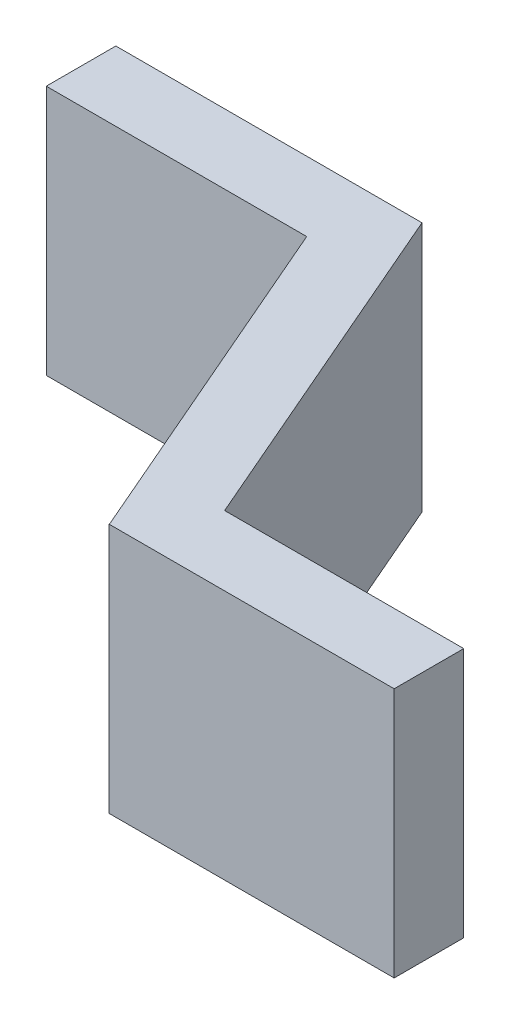
ISO-10303-21;
HEADER;
FILE_DESCRIPTION(('STEP AP214'),'2;1');
FILE_NAME('part.step','',(''),(''),'','','');
FILE_SCHEMA(('AUTOMOTIVE_DESIGN { 1 0 10303 214 1 1 1 1 }'));
ENDSEC;
DATA;
#1=APPLICATION_CONTEXT('core data for automotive mechanical design processes');
#2=APPLICATION_PROTOCOL_DEFINITION('international standard','automotive_design',2000,#1);
#3=PRODUCT_CONTEXT('',#1,'mechanical');
#4=PRODUCT('Part','Part','',(#3));
#5=PRODUCT_RELATED_PRODUCT_CATEGORY('part','',(#4));
#6=PRODUCT_DEFINITION_FORMATION('','',#4);
#7=PRODUCT_DEFINITION_CONTEXT('part definition',#1,'design');
#8=PRODUCT_DEFINITION('design','',#6,#7);
#9=PRODUCT_DEFINITION_SHAPE('','',#8);
#10=(LENGTH_UNIT() NAMED_UNIT(*) SI_UNIT(.MILLI.,.METRE.));
#11=(NAMED_UNIT(*) PLANE_ANGLE_UNIT() SI_UNIT($,.RADIAN.));
#12=(NAMED_UNIT(*) SI_UNIT($,.STERADIAN.) SOLID_ANGLE_UNIT());
#13=UNCERTAINTY_MEASURE_WITH_UNIT(LENGTH_MEASURE(1.E-05),#10,'distance_accuracy_value','');
#14=(GEOMETRIC_REPRESENTATION_CONTEXT(3) GLOBAL_UNCERTAINTY_ASSIGNED_CONTEXT((#13)) GLOBAL_UNIT_ASSIGNED_CONTEXT((#10,
#11,#12)) REPRESENTATION_CONTEXT('',''));
#15=CARTESIAN_POINT('',(0.,0.,0.));
#16=DIRECTION('',(0.,0.,1.));
#17=DIRECTION('',(1.,0.,0.));
#18=AXIS2_PLACEMENT_3D('',#15,#16,#17);
#19=CARTESIAN_POINT('',(0.,9.82,0.));
#20=DIRECTION('',(1.,0.,0.));
#21=DIRECTION('',(0.,0.,-1.));
#22=AXIS2_PLACEMENT_3D('',#19,#20,#21);
#23=PLANE('',#22);
#24=DIRECTION('',(0.,1.,0.));
#25=VECTOR('',#24,1.);
#26=CARTESIAN_POINT('',(0.,9.82,0.));
#27=LINE('',#26,#25);
#28=CARTESIAN_POINT('',(0.,10.180000014305,-1.30339419427667E-10));
#29=VERTEX_POINT('',#28);
#30=CARTESIAN_POINT('',(0.,9.82,-1.556831963824E-10));
#31=VERTEX_POINT('',#30);
#32=EDGE_CURVE('E123',#29,#31,#27,.F.);
#33=ORIENTED_EDGE('',*,*,#32,.T.);
#34=DIRECTION('',(0.,0.,1.));
#35=VECTOR('',#34,1.);
#36=CARTESIAN_POINT('',(0.,9.82,0.));
#37=LINE('',#36,#35);
#38=CARTESIAN_POINT('',(0.,9.82,0.10000000149));
#39=VERTEX_POINT('',#38);
#40=EDGE_CURVE('E115',#31,#39,#37,.T.);
#41=ORIENTED_EDGE('',*,*,#40,.T.);
#42=DIRECTION('',(0.,1.,0.));
#43=VECTOR('',#42,1.);
#44=CARTESIAN_POINT('',(0.,9.82,0.10000000149));
#45=LINE('',#44,#43);
#46=CARTESIAN_POINT('',(0.,10.180000014305,0.10000000149));
#47=VERTEX_POINT('',#46);
#48=EDGE_CURVE('E134',#47,#39,#45,.F.);
#49=ORIENTED_EDGE('',*,*,#48,.F.);
#50=DIRECTION('',(0.,0.,1.));
#51=VECTOR('',#50,1.);
#52=CARTESIAN_POINT('',(0.,10.180000014305,0.));
#53=LINE('',#52,#51);
#54=EDGE_CURVE('E140',#29,#47,#53,.T.);
#55=ORIENTED_EDGE('',*,*,#54,.F.);
#56=EDGE_LOOP('',(#33,#41,#49,#55));
#57=FACE_BOUND('',#56,.T.);
#58=ADVANCED_FACE('F17',(#57),#23,.F.);
#59=CARTESIAN_POINT('',(0.,9.82,0.10000000149));
#60=DIRECTION('',(0.,0.,1.));
#61=DIRECTION('',(1.,0.,0.));
#62=AXIS2_PLACEMENT_3D('',#59,#60,#61);
#63=PLANE('',#62);
#64=DIRECTION('',(0.,1.,0.));
#65=VECTOR('',#64,1.);
#66=CARTESIAN_POINT('',(0.374312226605181,9.82,0.100000001489922));
#67=LINE('',#66,#65);
#68=CARTESIAN_POINT('',(0.37431222660506,10.180000014305,0.100000001489974));
#69=VERTEX_POINT('',#68);
#70=CARTESIAN_POINT('',(0.374312226605091,9.82,0.100000001489974));
#71=VERTEX_POINT('',#70);
#72=EDGE_CURVE('E132',#69,#71,#67,.F.);
#73=ORIENTED_EDGE('',*,*,#72,.F.);
#74=DIRECTION('',(1.,0.,0.));
#75=VECTOR('',#74,1.);
#76=CARTESIAN_POINT('',(0.44,10.180000014305,0.10000000149));
#77=LINE('',#76,#75);
#78=EDGE_CURVE('E137',#47,#69,#77,.T.);
#79=ORIENTED_EDGE('',*,*,#78,.F.);
#80=ORIENTED_EDGE('',*,*,#48,.T.);
#81=DIRECTION('',(1.,0.,0.));
#82=VECTOR('',#81,1.);
#83=CARTESIAN_POINT('',(0.44,9.82,0.10000000149));
#84=LINE('',#83,#82);
#85=EDGE_CURVE('E111',#39,#71,#84,.T.);
#86=ORIENTED_EDGE('',*,*,#85,.T.);
#87=EDGE_LOOP('',(#73,#79,#80,#86));
#88=FACE_BOUND('',#87,.T.);
#89=ADVANCED_FACE('F214',(#88),#63,.T.);
#90=CARTESIAN_POINT('',(0.348224508223,9.82,0.03971472531736));
#91=DIRECTION('',(-0.917754904098641,0.,0.397147247255844));
#92=DIRECTION('',(0.397147247255844,0.,0.917754904098641));
#93=AXIS2_PLACEMENT_3D('',#90,#91,#92);
#94=PLANE('',#93);
#95=DIRECTION('',(0.397147247255413,0.,0.917754904098827));
#96=VECTOR('',#95,1.);
#97=CARTESIAN_POINT('',(0.374312226605,9.82,0.10000000149));
#98=LINE('',#97,#96);
#99=CARTESIAN_POINT('',(0.59,9.82,0.59842599627));
#100=VERTEX_POINT('',#99);
#101=EDGE_CURVE('E110',#71,#100,#98,.T.);
#102=ORIENTED_EDGE('',*,*,#101,.T.);
#103=DIRECTION('',(0.,1.,0.));
#104=VECTOR('',#103,1.);
#105=CARTESIAN_POINT('',(0.59,9.82,0.59842599627));
#106=LINE('',#105,#104);
#107=CARTESIAN_POINT('',(0.59,10.180000014305,0.59842599627));
#108=VERTEX_POINT('',#107);
#109=EDGE_CURVE('E86',#100,#108,#106,.T.);
#110=ORIENTED_EDGE('',*,*,#109,.T.);
#111=DIRECTION('',(0.397147247255413,0.,0.917754904098827));
#112=VECTOR('',#111,1.);
#113=CARTESIAN_POINT('',(0.374312226605,10.180000014305,0.10000000149));
#114=LINE('',#113,#112);
#115=EDGE_CURVE('E139',#69,#108,#114,.T.);
#116=ORIENTED_EDGE('',*,*,#115,.F.);
#117=ORIENTED_EDGE('',*,*,#72,.T.);
#118=EDGE_LOOP('',(#102,#110,#116,#117));
#119=FACE_BOUND('',#118,.T.);
#120=ADVANCED_FACE('F215',(#119),#94,.T.);
#121=CARTESIAN_POINT('',(0.59,9.82,0.5));
#122=DIRECTION('',(1.,0.,0.));
#123=DIRECTION('',(0.,0.,-1.));
#124=AXIS2_PLACEMENT_3D('',#121,#122,#123);
#125=PLANE('',#124);
#126=ORIENTED_EDGE('',*,*,#109,.F.);
#127=DIRECTION('',(0.,0.,-1.));
#128=VECTOR('',#127,1.);
#129=CARTESIAN_POINT('',(0.59,9.82,0.5));
#130=LINE('',#129,#128);
#131=CARTESIAN_POINT('',(0.59,9.82,0.60000000149));
#132=VERTEX_POINT('',#131);
#133=EDGE_CURVE('E20',#100,#132,#130,.F.);
#134=ORIENTED_EDGE('',*,*,#133,.T.);
#135=DIRECTION('',(0.,1.,0.));
#136=VECTOR('',#135,1.);
#137=CARTESIAN_POINT('',(0.59,9.82,0.60000000149));
#138=LINE('',#137,#136);
#139=CARTESIAN_POINT('',(0.59,10.180000014305,0.60000000149));
#140=VERTEX_POINT('',#139);
#141=EDGE_CURVE('E93',#140,#132,#138,.F.);
#142=ORIENTED_EDGE('',*,*,#141,.F.);
#143=DIRECTION('',(0.,0.,1.));
#144=VECTOR('',#143,1.);
#145=CARTESIAN_POINT('',(0.59,10.180000014305,0.));
#146=LINE('',#145,#144);
#147=EDGE_CURVE('E182',#108,#140,#146,.T.);
#148=ORIENTED_EDGE('',*,*,#147,.F.);
#149=EDGE_LOOP('',(#126,#134,#142,#148));
#150=FACE_BOUND('',#149,.T.);
#151=ADVANCED_FACE('F109',(#150),#125,.F.);
#152=CARTESIAN_POINT('',(0.59,9.82,0.60000000149));
#153=DIRECTION('',(0.,0.,1.));
#154=DIRECTION('',(1.,0.,0.));
#155=AXIS2_PLACEMENT_3D('',#152,#153,#154);
#156=PLANE('',#155);
#157=ORIENTED_EDGE('',*,*,#141,.T.);
#158=DIRECTION('',(1.,0.,0.));
#159=VECTOR('',#158,1.);
#160=CARTESIAN_POINT('',(0.44,9.82,0.60000000149));
#161=LINE('',#160,#159);
#162=CARTESIAN_POINT('',(0.999999996424,9.82,0.60000000149));
#163=VERTEX_POINT('',#162);
#164=EDGE_CURVE('E97',#132,#163,#161,.T.);
#165=ORIENTED_EDGE('',*,*,#164,.T.);
#166=DIRECTION('',(0.,1.,0.));
#167=VECTOR('',#166,1.);
#168=CARTESIAN_POINT('',(0.999999996424,9.82,0.60000000149));
#169=LINE('',#168,#167);
#170=CARTESIAN_POINT('',(0.999999996424,10.180000014305,0.60000000149));
#171=VERTEX_POINT('',#170);
#172=EDGE_CURVE('E99',#171,#163,#169,.F.);
#173=ORIENTED_EDGE('',*,*,#172,.F.);
#174=DIRECTION('',(1.,0.,0.));
#175=VECTOR('',#174,1.);
#176=CARTESIAN_POINT('',(0.44,10.180000014305,0.60000000149));
#177=LINE('',#176,#175);
#178=EDGE_CURVE('E98',#140,#171,#177,.T.);
#179=ORIENTED_EDGE('',*,*,#178,.F.);
#180=EDGE_LOOP('',(#157,#165,#173,#179));
#181=FACE_BOUND('',#180,.T.);
#182=ADVANCED_FACE('F95',(#181),#156,.T.);
#183=CARTESIAN_POINT('',(0.999999996424,9.82,0.5));
#184=DIRECTION('',(1.,0.,0.));
#185=DIRECTION('',(0.,0.,-1.));
#186=AXIS2_PLACEMENT_3D('',#183,#184,#185);
#187=PLANE('',#186);
#188=DIRECTION('',(0.,0.,1.));
#189=VECTOR('',#188,1.);
#190=CARTESIAN_POINT('',(0.999999996424,9.82,0.));
#191=LINE('',#190,#189);
#192=CARTESIAN_POINT('',(0.999999996424,9.82,0.5));
#193=VERTEX_POINT('',#192);
#194=EDGE_CURVE('E107',#163,#193,#191,.F.);
#195=ORIENTED_EDGE('',*,*,#194,.T.);
#196=DIRECTION('',(0.,1.,0.));
#197=VECTOR('',#196,1.);
#198=CARTESIAN_POINT('',(0.999999996424,9.82,0.5));
#199=LINE('',#198,#197);
#200=CARTESIAN_POINT('',(0.999999996424,10.180000014305,0.5));
#201=VERTEX_POINT('',#200);
#202=EDGE_CURVE('E192',#193,#201,#199,.T.);
#203=ORIENTED_EDGE('',*,*,#202,.T.);
#204=DIRECTION('',(0.,0.,1.));
#205=VECTOR('',#204,1.);
#206=CARTESIAN_POINT('',(0.999999996424,10.180000014305,0.));
#207=LINE('',#206,#205);
#208=EDGE_CURVE('E126',#171,#201,#207,.F.);
#209=ORIENTED_EDGE('',*,*,#208,.F.);
#210=ORIENTED_EDGE('',*,*,#172,.T.);
#211=EDGE_LOOP('',(#195,#203,#209,#210));
#212=FACE_BOUND('',#211,.T.);
#213=ADVANCED_FACE('F238',(#212),#187,.T.);
#214=CARTESIAN_POINT('',(0.,9.82,0.));
#215=DIRECTION('',(0.,0.,1.));
#216=DIRECTION('',(1.,0.,0.));
#217=AXIS2_PLACEMENT_3D('',#214,#215,#216);
#218=PLANE('',#217);
#219=DIRECTION('',(1.,0.,0.));
#220=VECTOR('',#219,1.);
#221=CARTESIAN_POINT('',(0.44,9.82,-2.335247945736E-10));
#222=LINE('',#221,#220);
#223=CARTESIAN_POINT('',(0.439999999656335,9.82,-3.43069646239979E-10));
#224=VERTEX_POINT('',#223);
#225=EDGE_CURVE('E155',#224,#31,#222,.F.);
#226=ORIENTED_EDGE('',*,*,#225,.T.);
#227=ORIENTED_EDGE('',*,*,#32,.F.);
#228=DIRECTION('',(1.,0.,0.));
#229=VECTOR('',#228,1.);
#230=CARTESIAN_POINT('',(0.44,10.180000014305,-1.955091291415E-10));
#231=LINE('',#230,#229);
#232=CARTESIAN_POINT('',(0.439999999458534,10.180000014305,-1.955091291415E-10));
#233=VERTEX_POINT('',#232);
#234=EDGE_CURVE('E147',#233,#29,#231,.F.);
#235=ORIENTED_EDGE('',*,*,#234,.F.);
#236=DIRECTION('',(0.,1.,0.));
#237=VECTOR('',#236,1.);
#238=CARTESIAN_POINT('',(0.439999999804137,9.82,-4.52614497906357E-10));
#239=LINE('',#238,#237);
#240=EDGE_CURVE('E128',#233,#224,#239,.F.);
#241=ORIENTED_EDGE('',*,*,#240,.T.);
#242=EDGE_LOOP('',(#226,#227,#235,#241));
#243=FACE_BOUND('',#242,.T.);
#244=ADVANCED_FACE('F235',(#243),#218,.F.);
#245=CARTESIAN_POINT('',(0.44,9.82,0.));
#246=DIRECTION('',(0.,1.,0.));
#247=DIRECTION('',(0.,0.,1.));
#248=AXIS2_PLACEMENT_3D('',#245,#246,#247);
#249=PLANE('',#248);
#250=DIRECTION('',(1.,0.,0.));
#251=VECTOR('',#250,1.);
#252=CARTESIAN_POINT('',(0.59,9.82,0.5));
#253=LINE('',#252,#251);
#254=CARTESIAN_POINT('',(0.656368904967001,9.82,0.499999999999999));
#255=VERTEX_POINT('',#254);
#256=EDGE_CURVE('E166',#255,#193,#253,.T.);
#257=ORIENTED_EDGE('',*,*,#256,.T.);
#258=ORIENTED_EDGE('',*,*,#194,.F.);
#259=ORIENTED_EDGE('',*,*,#164,.F.);
#260=ORIENTED_EDGE('',*,*,#133,.F.);
#261=ORIENTED_EDGE('',*,*,#101,.F.);
#262=ORIENTED_EDGE('',*,*,#85,.F.);
#263=ORIENTED_EDGE('',*,*,#40,.F.);
#264=ORIENTED_EDGE('',*,*,#225,.F.);
#265=DIRECTION('',(0.397147247255844,0.,0.917754904098641));
#266=VECTOR('',#265,1.);
#267=CARTESIAN_POINT('',(0.44,9.82,0.));
#268=LINE('',#267,#266);
#269=EDGE_CURVE('E160',#224,#255,#268,.T.);
#270=ORIENTED_EDGE('',*,*,#269,.T.);
#271=EDGE_LOOP('',(#257,#258,#259,#260,#261,#262,#263,#264,#270));
#272=FACE_BOUND('',#271,.T.);
#273=ADVANCED_FACE('F104',(#272),#249,.F.);
#274=CARTESIAN_POINT('',(0.59,9.82,0.5));
#275=DIRECTION('',(0.,0.,1.));
#276=DIRECTION('',(1.,0.,0.));
#277=AXIS2_PLACEMENT_3D('',#274,#275,#276);
#278=PLANE('',#277);
#279=ORIENTED_EDGE('',*,*,#256,.F.);
#280=DIRECTION('',(0.,1.,0.));
#281=VECTOR('',#280,1.);
#282=CARTESIAN_POINT('',(0.656368904967005,9.82,0.499999999999998));
#283=LINE('',#282,#281);
#284=CARTESIAN_POINT('',(0.656368904967001,10.180000014305,0.499999999999999));
#285=VERTEX_POINT('',#284);
#286=EDGE_CURVE('E26',#255,#285,#283,.T.);
#287=ORIENTED_EDGE('',*,*,#286,.T.);
#288=DIRECTION('',(1.,0.,0.));
#289=VECTOR('',#288,1.);
#290=CARTESIAN_POINT('',(0.44,10.180000014305,0.5));
#291=LINE('',#290,#289);
#292=EDGE_CURVE('E34',#201,#285,#291,.F.);
#293=ORIENTED_EDGE('',*,*,#292,.F.);
#294=ORIENTED_EDGE('',*,*,#202,.F.);
#295=EDGE_LOOP('',(#279,#287,#293,#294));
#296=FACE_BOUND('',#295,.T.);
#297=ADVANCED_FACE('F199',(#296),#278,.F.);
#298=CARTESIAN_POINT('',(0.44,10.180000014305,0.));
#299=DIRECTION('',(0.,1.,0.));
#300=DIRECTION('',(0.,0.,1.));
#301=AXIS2_PLACEMENT_3D('',#298,#299,#300);
#302=PLANE('',#301);
#303=ORIENTED_EDGE('',*,*,#178,.T.);
#304=ORIENTED_EDGE('',*,*,#208,.T.);
#305=ORIENTED_EDGE('',*,*,#292,.T.);
#306=DIRECTION('',(0.397147247255844,0.,0.917754904098641));
#307=VECTOR('',#306,1.);
#308=CARTESIAN_POINT('',(0.44,10.180000014305,0.));
#309=LINE('',#308,#307);
#310=EDGE_CURVE('E11',#285,#233,#309,.F.);
#311=ORIENTED_EDGE('',*,*,#310,.T.);
#312=ORIENTED_EDGE('',*,*,#234,.T.);
#313=ORIENTED_EDGE('',*,*,#54,.T.);
#314=ORIENTED_EDGE('',*,*,#78,.T.);
#315=ORIENTED_EDGE('',*,*,#115,.T.);
#316=ORIENTED_EDGE('',*,*,#147,.T.);
#317=EDGE_LOOP('',(#303,#304,#305,#311,#312,#313,#314,#315,#316));
#318=FACE_BOUND('',#317,.T.);
#319=ADVANCED_FACE('F204',(#318),#302,.T.);
#320=CARTESIAN_POINT('',(0.44,9.82,0.));
#321=DIRECTION('',(-0.917754904098641,0.,0.397147247255844));
#322=DIRECTION('',(0.397147247255844,0.,0.917754904098641));
#323=AXIS2_PLACEMENT_3D('',#320,#321,#322);
#324=PLANE('',#323);
#325=ORIENTED_EDGE('',*,*,#286,.F.);
#326=ORIENTED_EDGE('',*,*,#269,.F.);
#327=ORIENTED_EDGE('',*,*,#240,.F.);
#328=ORIENTED_EDGE('',*,*,#310,.F.);
#329=EDGE_LOOP('',(#325,#326,#327,#328));
#330=FACE_BOUND('',#329,.T.);
#331=ADVANCED_FACE('F201',(#330),#324,.F.);
#332=CLOSED_SHELL('',(#58,#89,#120,#151,#182,#213,#244,#273,#297,#319,#331));
#333=MANIFOLD_SOLID_BREP('B1',#332);
#334=ADVANCED_BREP_SHAPE_REPRESENTATION('',(#18,#333),#14);
#335=SHAPE_DEFINITION_REPRESENTATION(#9,#334);
ENDSEC;
END-ISO-10303-21;
